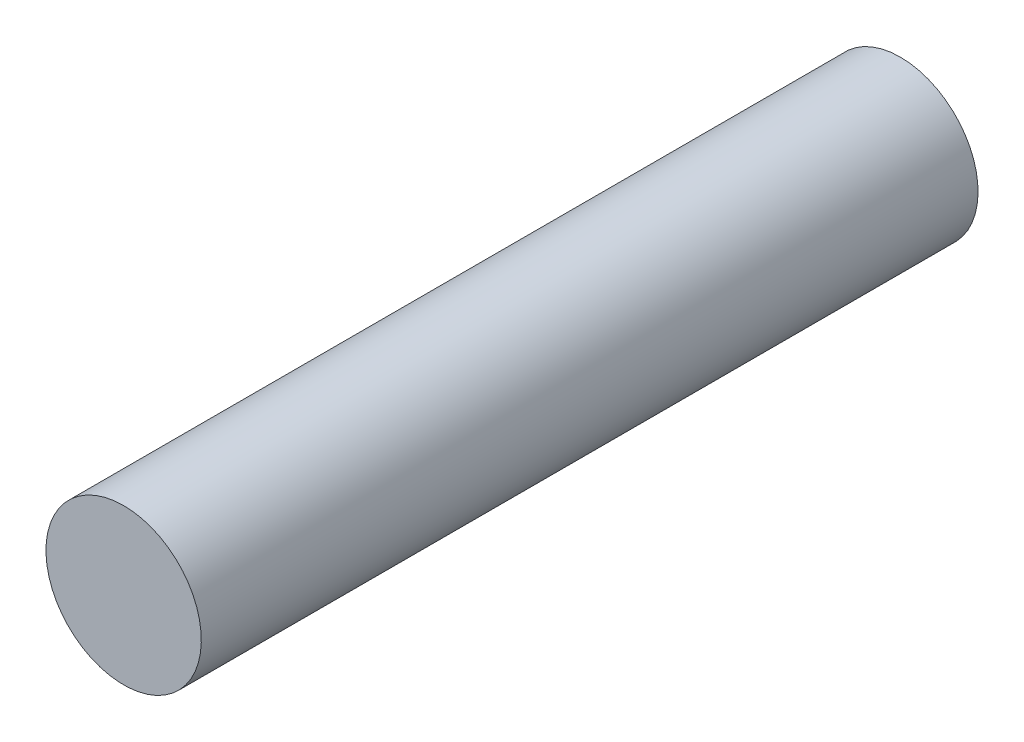
ISO-10303-21;
HEADER;
FILE_DESCRIPTION(('STEP AP214'),'2;1');
FILE_NAME('part.step','',(''),(''),'','','');
FILE_SCHEMA(('AUTOMOTIVE_DESIGN { 1 0 10303 214 1 1 1 1 }'));
ENDSEC;
DATA;
#1=APPLICATION_CONTEXT('core data for automotive mechanical design processes');
#2=APPLICATION_PROTOCOL_DEFINITION('international standard','automotive_design',2000,#1);
#3=PRODUCT_CONTEXT('',#1,'mechanical');
#4=PRODUCT('Part','Part','',(#3));
#5=PRODUCT_RELATED_PRODUCT_CATEGORY('part','',(#4));
#6=PRODUCT_DEFINITION_FORMATION('','',#4);
#7=PRODUCT_DEFINITION_CONTEXT('part definition',#1,'design');
#8=PRODUCT_DEFINITION('design','',#6,#7);
#9=PRODUCT_DEFINITION_SHAPE('','',#8);
#10=(LENGTH_UNIT() NAMED_UNIT(*) SI_UNIT(.MILLI.,.METRE.));
#11=(NAMED_UNIT(*) PLANE_ANGLE_UNIT() SI_UNIT($,.RADIAN.));
#12=(NAMED_UNIT(*) SI_UNIT($,.STERADIAN.) SOLID_ANGLE_UNIT());
#13=UNCERTAINTY_MEASURE_WITH_UNIT(LENGTH_MEASURE(1.E-05),#10,'distance_accuracy_value','');
#14=(GEOMETRIC_REPRESENTATION_CONTEXT(3) GLOBAL_UNCERTAINTY_ASSIGNED_CONTEXT((#13)) GLOBAL_UNIT_ASSIGNED_CONTEXT((#10,
#11,#12)) REPRESENTATION_CONTEXT('',''));
#15=CARTESIAN_POINT('',(0.,0.,0.));
#16=DIRECTION('',(0.,0.,1.));
#17=DIRECTION('',(1.,0.,0.));
#18=AXIS2_PLACEMENT_3D('',#15,#16,#17);
#19=CARTESIAN_POINT('',(0.,0.,15.875));
#20=DIRECTION('',(0.,0.,1.));
#21=DIRECTION('',(0.,-1.,0.));
#22=AXIS2_PLACEMENT_3D('',#19,#20,#21);
#23=CYLINDRICAL_SURFACE('',#22,3.175);
#24=CARTESIAN_POINT('',(0.,0.,-15.875));
#25=DIRECTION('',(0.,0.,-1.));
#26=DIRECTION('',(0.,1.,0.));
#27=AXIS2_PLACEMENT_3D('',#24,#25,#26);
#28=CIRCLE('',#27,3.17499999999998);
#29=CARTESIAN_POINT('',(0.,3.17499999999998,-15.875));
#30=VERTEX_POINT('',#29);
#31=EDGE_CURVE('E42',#30,#30,#28,.T.);
#32=ORIENTED_EDGE('',*,*,#31,.F.);
#33=EDGE_LOOP('',(#32));
#34=FACE_BOUND('',#33,.T.);
#35=CARTESIAN_POINT('',(0.,0.,15.875));
#36=DIRECTION('',(0.,0.,-1.));
#37=DIRECTION('',(0.,1.,0.));
#38=AXIS2_PLACEMENT_3D('',#35,#36,#37);
#39=CIRCLE('',#38,3.17499999999998);
#40=CARTESIAN_POINT('',(0.,3.17499999999998,15.875));
#41=VERTEX_POINT('',#40);
#42=EDGE_CURVE('E10',#41,#41,#39,.F.);
#43=ORIENTED_EDGE('',*,*,#42,.F.);
#44=EDGE_LOOP('',(#43));
#45=FACE_BOUND('',#44,.T.);
#46=ADVANCED_FACE('F35',(#34,#45),#23,.T.);
#47=CARTESIAN_POINT('',(0.,3.175,15.875));
#48=DIRECTION('',(0.,0.,-1.));
#49=DIRECTION('',(0.,1.,0.));
#50=AXIS2_PLACEMENT_3D('',#47,#48,#49);
#51=PLANE('',#50);
#52=ORIENTED_EDGE('',*,*,#42,.T.);
#53=EDGE_LOOP('',(#52));
#54=FACE_BOUND('',#53,.T.);
#55=ADVANCED_FACE('F37',(#54),#51,.F.);
#56=CARTESIAN_POINT('',(0.,3.175,-15.875));
#57=DIRECTION('',(0.,0.,1.));
#58=DIRECTION('',(0.,-1.,0.));
#59=AXIS2_PLACEMENT_3D('',#56,#57,#58);
#60=PLANE('',#59);
#61=ORIENTED_EDGE('',*,*,#31,.T.);
#62=EDGE_LOOP('',(#61));
#63=FACE_BOUND('',#62,.T.);
#64=ADVANCED_FACE('F48',(#63),#60,.F.);
#65=CLOSED_SHELL('',(#46,#55,#64));
#66=MANIFOLD_SOLID_BREP('B2',#65);
#67=ADVANCED_BREP_SHAPE_REPRESENTATION('',(#18,#66),#14);
#68=SHAPE_DEFINITION_REPRESENTATION(#9,#67);
ENDSEC;
END-ISO-10303-21;
